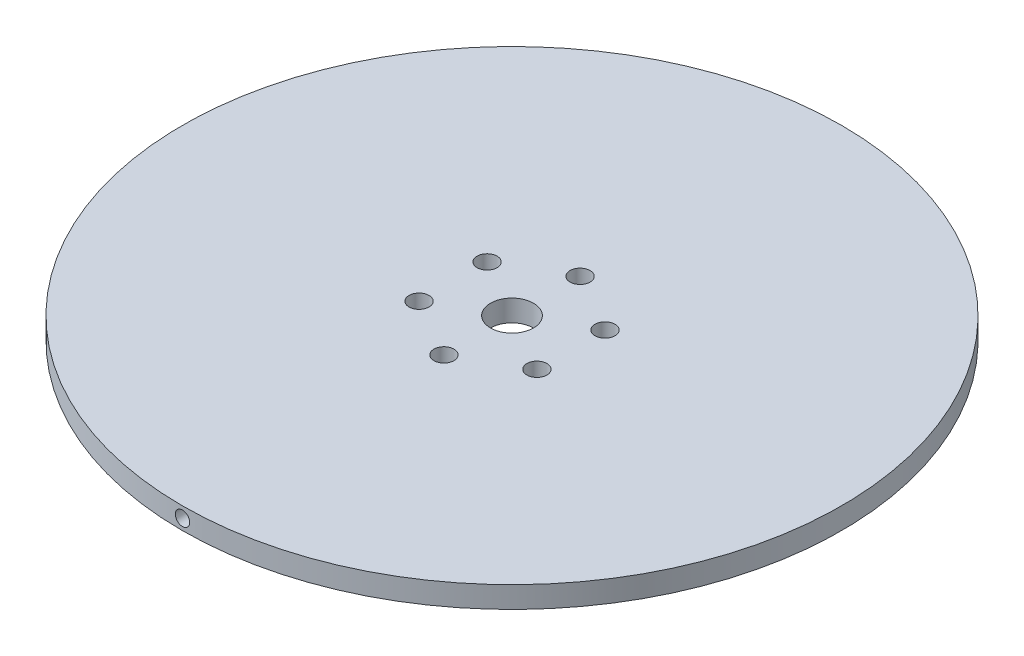
ISO-10303-21;
HEADER;
FILE_DESCRIPTION(('STEP AP214'),'2;1');
FILE_NAME('part.step','',(''),(''),'','','');
FILE_SCHEMA(('AUTOMOTIVE_DESIGN { 1 0 10303 214 1 1 1 1 }'));
ENDSEC;
DATA;
#1=APPLICATION_CONTEXT('core data for automotive mechanical design processes');
#2=APPLICATION_PROTOCOL_DEFINITION('international standard','automotive_design',2000,#1);
#3=PRODUCT_CONTEXT('',#1,'mechanical');
#4=PRODUCT('Part','Part','',(#3));
#5=PRODUCT_RELATED_PRODUCT_CATEGORY('part','',(#4));
#6=PRODUCT_DEFINITION_FORMATION('','',#4);
#7=PRODUCT_DEFINITION_CONTEXT('part definition',#1,'design');
#8=PRODUCT_DEFINITION('design','',#6,#7);
#9=PRODUCT_DEFINITION_SHAPE('','',#8);
#10=(LENGTH_UNIT() NAMED_UNIT(*) SI_UNIT(.MILLI.,.METRE.));
#11=(NAMED_UNIT(*) PLANE_ANGLE_UNIT() SI_UNIT($,.RADIAN.));
#12=(NAMED_UNIT(*) SI_UNIT($,.STERADIAN.) SOLID_ANGLE_UNIT());
#13=UNCERTAINTY_MEASURE_WITH_UNIT(LENGTH_MEASURE(1.E-05),#10,'distance_accuracy_value','');
#14=(GEOMETRIC_REPRESENTATION_CONTEXT(3) GLOBAL_UNCERTAINTY_ASSIGNED_CONTEXT((#13)) GLOBAL_UNIT_ASSIGNED_CONTEXT((#10,
#11,#12)) REPRESENTATION_CONTEXT('',''));
#15=CARTESIAN_POINT('',(0.,0.,0.));
#16=DIRECTION('',(0.,0.,1.));
#17=DIRECTION('',(1.,0.,0.));
#18=AXIS2_PLACEMENT_3D('',#15,#16,#17);
#19=CARTESIAN_POINT('',(0.,3.,0.));
#20=DIRECTION('',(0.,-1.,0.));
#21=DIRECTION('',(0.,0.,-1.));
#22=AXIS2_PLACEMENT_3D('',#19,#20,#21);
#23=CYLINDRICAL_SURFACE('',#22,46.);
#24=CARTESIAN_POINT('',(1.,1.5,45.9891291502677));
#25=CARTESIAN_POINT('',(0.999997511577895,1.44383668192048,45.989129297113));
#26=CARTESIAN_POINT('',(0.995252643432108,1.38763280904419,45.9892331377666));
#27=CARTESIAN_POINT('',(0.976390540344761,1.2767734357133,45.9896373879013));
#28=CARTESIAN_POINT('',(0.962262069324126,1.22211987353279,45.989938033033));
#29=CARTESIAN_POINT('',(0.925035594017819,1.11598320695427,45.9907018186868));
#30=CARTESIAN_POINT('',(0.901941928436637,1.06449858289106,45.9911648805968));
#31=CARTESIAN_POINT('',(0.847446706922223,0.966151427471239,45.992201221132));
#32=CARTESIAN_POINT('',(0.816047196974829,0.919287761727317,45.9927744726045));
#33=CARTESIAN_POINT('',(0.745819770920086,0.83148384653955,45.9939668088042));
#34=CARTESIAN_POINT('',(0.706989982843991,0.790545094380747,45.9945859050574));
#35=CARTESIAN_POINT('',(0.623007049994596,0.715765549477957,45.99580004856));
#36=CARTESIAN_POINT('',(0.57785365518583,0.681925037530667,45.9963950948573));
#37=CARTESIAN_POINT('',(0.482501819334214,0.622301903456958,45.9974940840829));
#38=CARTESIAN_POINT('',(0.432302973228183,0.59651992897683,45.9979980196874));
#39=CARTESIAN_POINT('',(0.328288136177957,0.55375004631892,45.9988579111808));
#40=CARTESIAN_POINT('',(0.274472156301269,0.536762111235011,45.9992138675224));
#41=CARTESIAN_POINT('',(0.164759680973002,0.512065063717347,45.9997376232077));
#42=CARTESIAN_POINT('',(0.108863516241619,0.504354482756667,45.99990545233));
#43=CARTESIAN_POINT('',(-0.0034300616357755,0.498426504052758,46.0000341334473));
#44=CARTESIAN_POINT('',(-0.0598274733021953,0.500209078296704,45.9999949860529));
#45=CARTESIAN_POINT('',(-0.171512663698002,0.513215541532607,45.999714153383));
#46=CARTESIAN_POINT('',(-0.22680062805595,0.524437837390395,45.9994725022838));
#47=CARTESIAN_POINT('',(-0.334707664635909,0.556002724290932,45.9988139406583));
#48=CARTESIAN_POINT('',(-0.387326732436203,0.576345330443284,45.9983970298415));
#49=CARTESIAN_POINT('',(-0.488407388988871,0.625575208410584,45.9974348852464));
#50=CARTESIAN_POINT('',(-0.536868621771618,0.65446321089278,45.9968896404957));
#51=CARTESIAN_POINT('',(-0.628254040646019,0.719963295991373,45.9957322874783));
#52=CARTESIAN_POINT('',(-0.671178221155693,0.75657538639443,45.9951201791442));
#53=CARTESIAN_POINT('',(-0.750280369638865,0.836493387571615,45.993897945175));
#54=CARTESIAN_POINT('',(-0.78645693922167,0.87980068248213,45.9932878199765));
#55=CARTESIAN_POINT('',(-0.851026170394438,0.971874857392614,45.992138466305));
#56=CARTESIAN_POINT('',(-0.879418830844243,1.02064173819228,45.9915992378424));
#57=CARTESIAN_POINT('',(-0.927614105922277,1.12225152082327,45.9906524847887));
#58=CARTESIAN_POINT('',(-0.94741667733152,1.17509444316064,45.9902449608603));
#59=CARTESIAN_POINT('',(-0.9778687539727,1.28335592106462,45.9896075939928));
#60=CARTESIAN_POINT('',(-0.988518272492743,1.33877447289188,45.9893777507958));
#61=CARTESIAN_POINT('',(-1.00036022763924,1.45060190107335,45.9891217059326));
#62=CARTESIAN_POINT('',(-1.00155460004287,1.50701057234752,45.9890954625829));
#63=CARTESIAN_POINT('',(-0.994457401227389,1.6192276579359,45.9892494675996));
#64=CARTESIAN_POINT('',(-0.986165835573732,1.67503607260226,45.9894297158448));
#65=CARTESIAN_POINT('',(-0.96033373303996,1.78446303448477,45.9899763456738));
#66=CARTESIAN_POINT('',(-0.942794073990027,1.83808178902337,45.9903427095914));
#67=CARTESIAN_POINT('',(-0.898964569986483,1.94161372676329,45.9912202533275));
#68=CARTESIAN_POINT('',(-0.872674716316518,1.99152690627331,45.9917314332901));
#69=CARTESIAN_POINT('',(-0.812086112539145,2.08623974269923,45.9928410826945));
#70=CARTESIAN_POINT('',(-0.777786058246107,2.1310385651477,45.9934395663446));
#71=CARTESIAN_POINT('',(-0.702152628091753,2.21424262652956,45.9946563020191));
#72=CARTESIAN_POINT('',(-0.660819241459442,2.25264785567147,45.9952745540738));
#73=CARTESIAN_POINT('',(-0.572284178653449,2.32198097532061,45.9964612484108));
#74=CARTESIAN_POINT('',(-0.525081524371783,2.35290761699258,45.997029682364));
#75=CARTESIAN_POINT('',(-0.426152880853017,2.40639710542382,45.998052540043));
#76=CARTESIAN_POINT('',(-0.37442689924032,2.42895996628051,45.9985069639609));
#77=CARTESIAN_POINT('',(-0.267924639490222,2.46507923624853,45.9992505331713));
#78=CARTESIAN_POINT('',(-0.213148637041824,2.47863645794489,45.9995396933753));
#79=CARTESIAN_POINT('',(-0.102097279266781,2.49636227933337,45.9999201964109));
#80=CARTESIAN_POINT('',(-0.0458219233459414,2.50053087530471,46.0000115391642));
#81=CARTESIAN_POINT('',(0.0666180868227192,2.49936100170221,45.9999861103992));
#82=CARTESIAN_POINT('',(0.122782761647158,2.49402450782439,45.9998693821298));
#83=CARTESIAN_POINT('',(0.233418864334116,2.4739999843119,45.9994410522522));
#84=CARTESIAN_POINT('',(0.287890288816029,2.45931193600794,45.999129450255));
#85=CARTESIAN_POINT('',(0.393594810775896,2.42100135146198,45.9983464828331));
#86=CARTESIAN_POINT('',(0.444827850223864,2.39737865516921,45.9978751145465));
#87=CARTESIAN_POINT('',(0.542599299394092,2.34187050012892,45.9968257525451));
#88=CARTESIAN_POINT('',(0.589137885708025,2.30998535235196,45.9962477628434));
#89=CARTESIAN_POINT('',(0.676207306570353,2.23885342055012,45.9950502035684));
#90=CARTESIAN_POINT('',(0.716737531125554,2.19960588998143,45.9944306297825));
#91=CARTESIAN_POINT('',(0.790644391956378,2.11485207355508,45.9932196268707));
#92=CARTESIAN_POINT('',(0.824019251247659,2.06934423759064,45.9926282047643));
#93=CARTESIAN_POINT('',(0.88267106055026,1.97334851784832,45.9915400427292));
#94=CARTESIAN_POINT('',(0.907943409036848,1.92285782544945,45.991043356667));
#95=CARTESIAN_POINT('',(0.949623312832998,1.81838834589232,45.9902017201949));
#96=CARTESIAN_POINT('',(0.966041465900257,1.76441381567776,45.9898565884792));
#97=CARTESIAN_POINT('',(0.985184160814804,1.67508074004354,45.9894494688706));
#98=CARTESIAN_POINT('',(0.99073313671866,1.64030233894591,45.9893298691666));
#99=CARTESIAN_POINT('',(0.998141835503598,1.57035459748846,45.9891696638733));
#100=CARTESIAN_POINT('',(1.00000155894941,1.53518525718848,45.9891290582719));
#101=CARTESIAN_POINT('',(1.,1.5,45.9891291502677));
#102=B_SPLINE_CURVE_WITH_KNOTS('',3,(#24,#25,#26,#27,#28,#29,#30,#31,#32,#33,#34,#35,#36,#37,
#38,#39,#40,#41,#42,#43,#44,#45,#46,#47,#48,#49,#50,#51,#52,#53,#54,#55,#56,#57,#58,#59,#60,#61,
#62,#63,#64,#65,#66,#67,#68,#69,#70,#71,#72,#73,#74,#75,#76,#77,#78,#79,#80,#81,#82,#83,#84,#85,
#86,#87,#88,#89,#90,#91,#92,#93,#94,#95,#96,#97,#98,#99,#100,#101),.UNSPECIFIED.,.T.,.F.,(4,2,2,
2,2,2,2,2,2,2,2,2,2,2,2,2,2,2,2,2,2,2,2,2,2,2,2,2,2,2,2,2,2,2,2,2,2,2,4),(0.,0.168361525686354,
0.336925014548214,0.505407028626971,0.67384757897122,0.842330621881101,1.01082032849382,
1.17932357276058,1.34782630147397,1.51630235411584,1.68477790961133,1.85322503732739,
2.02167244411056,2.19013425801914,2.35859624175507,2.52709309924956,2.69558998142482,
2.86408771134213,3.03258519663947,3.20104818410662,3.36951107273549,3.53795797372377,
3.70640504250798,3.87487955624733,4.04335432799447,4.21185721362927,4.38035981524547,
4.5488472106898,4.71733467290691,4.88578711797322,5.05423989933639,5.22269569842061,
5.39114515832263,5.55961170820054,5.72812004721579,5.89672391555732,6.06512552823566,
6.17060085788629,6.27607617139129),.UNSPECIFIED.);
#103=CARTESIAN_POINT('',(1.,1.5,45.9891291502677));
#104=VERTEX_POINT('',#103);
#105=EDGE_CURVE('E44',#104,#104,#102,.T.);
#106=ORIENTED_EDGE('',*,*,#105,.T.);
#107=EDGE_LOOP('',(#106));
#108=FACE_BOUND('',#107,.T.);
#109=CARTESIAN_POINT('',(0.,3.,0.));
#110=DIRECTION('',(0.,1.,0.));
#111=DIRECTION('',(0.,0.,1.));
#112=AXIS2_PLACEMENT_3D('',#109,#110,#111);
#113=CIRCLE('',#112,46.);
#114=CARTESIAN_POINT('',(0.,3.,46.));
#115=VERTEX_POINT('',#114);
#116=EDGE_CURVE('E48',#115,#115,#113,.T.);
#117=ORIENTED_EDGE('',*,*,#116,.F.);
#118=EDGE_LOOP('',(#117));
#119=FACE_BOUND('',#118,.T.);
#120=CARTESIAN_POINT('',(0.,0.,0.));
#121=DIRECTION('',(0.,1.,0.));
#122=DIRECTION('',(0.,0.,1.));
#123=AXIS2_PLACEMENT_3D('',#120,#121,#122);
#124=CIRCLE('',#123,46.);
#125=CARTESIAN_POINT('',(0.,0.,46.));
#126=VERTEX_POINT('',#125);
#127=EDGE_CURVE('E52',#126,#126,#124,.T.);
#128=ORIENTED_EDGE('',*,*,#127,.T.);
#129=EDGE_LOOP('',(#128));
#130=FACE_BOUND('',#129,.T.);
#131=CARTESIAN_POINT('',(0.,2.5,-46.));
#132=CARTESIAN_POINT('',(0.056163319848058,2.4999975115795,-45.999999853292));
#133=CARTESIAN_POINT('',(0.112367194486799,2.49525264314499,-45.9998960378786));
#134=CARTESIAN_POINT('',(0.223226571479499,2.47639053880658,-45.9994918777274));
#135=CARTESIAN_POINT('',(0.277880135560748,2.46226206682957,-45.9991912973865));
#136=CARTESIAN_POINT('',(0.384016806156987,2.42503558872489,-45.9984276524474));
#137=CARTESIAN_POINT('',(0.435501432321068,2.40194192125605,-45.997964666455));
#138=CARTESIAN_POINT('',(0.533848591254183,2.34744669529775,-45.9969284555555));
#139=CARTESIAN_POINT('',(0.58071225841321,2.31604718279882,-45.9963552578065));
#140=CARTESIAN_POINT('',(0.668516171975695,2.24581975417801,-45.9951629834455));
#141=CARTESIAN_POINT('',(0.709454921548896,2.20698996665626,-45.9945438952997));
#142=CARTESIAN_POINT('',(0.784234461469103,2.12300703599771,-45.9933297187334));
#143=CARTESIAN_POINT('',(0.818074971011495,2.07785364281843,-45.9927346312632));
#144=CARTESIAN_POINT('',(0.877698102591709,1.98250180836725,-45.9916355284732));
#145=CARTESIAN_POINT('',(0.903480076535621,1.93230296175223,-45.9911315204796));
#146=CARTESIAN_POINT('',(0.946249958061318,1.82828812359524,-45.990271484708));
#147=CARTESIAN_POINT('',(0.963237892555773,1.77447214312346,-45.989915456477));
#148=CARTESIAN_POINT('',(0.987934938810171,1.6647596660834,-45.9893915890842));
#149=CARTESIAN_POINT('',(0.995645519056297,1.60886350022619,-45.9892237201394));
#150=CARTESIAN_POINT('',(1.00157349594113,1.49656992015263,-45.9890950088477));
#151=CARTESIAN_POINT('',(0.999790920600147,1.44017250741628,-45.9891341658897));
#152=CARTESIAN_POINT('',(0.986784455650442,1.32848732192039,-45.9894150631277));
#153=CARTESIAN_POINT('',(0.975562160279575,1.27319936340363,-45.9896567691161));
#154=CARTESIAN_POINT('',(0.943997276386596,1.1652923382553,-45.9903154616555));
#155=CARTESIAN_POINT('',(0.923654672744069,1.11267327604863,-45.9907324484973));
#156=CARTESIAN_POINT('',(0.874424799925698,1.0115926261869,-45.9916947330544));
#157=CARTESIAN_POINT('',(0.845536799489114,0.963131394790606,-45.99224004175));
#158=CARTESIAN_POINT('',(0.780036718730857,0.87174597781691,-45.9933974824854));
#159=CARTESIAN_POINT('',(0.743424630623865,0.828821797820523,-45.9940096145926));
#160=CARTESIAN_POINT('',(0.66350663104734,0.749719646657924,-45.9952318456097));
#161=CARTESIAN_POINT('',(0.620199334979927,0.7135430743484,-45.9958419440724));
#162=CARTESIAN_POINT('',(0.528125156793367,0.648973838229441,-45.996991205381));
#163=CARTESIAN_POINT('',(0.479358273878326,0.62058117555474,-45.9975303682167));
#164=CARTESIAN_POINT('',(0.377748490734636,0.572385898886149,-45.9984769798962));
#165=CARTESIAN_POINT('',(0.324905570330828,0.55258332741384,-45.998884428088));
#166=CARTESIAN_POINT('',(0.216644096620438,0.52213125005136,-45.9995216665753));
#167=CARTESIAN_POINT('',(0.161225547049996,0.511481730884453,-45.9997514571285));
#168=CARTESIAN_POINT('',(0.0493981198216807,0.499639773308245,-46.0000074429437));
#169=CARTESIAN_POINT('',(-0.0070105528215482,0.498445399738928,-46.0000336798664));
#170=CARTESIAN_POINT('',(-0.119227641430148,0.505542596711976,-45.9998797109533));
#171=CARTESIAN_POINT('',(-0.175036057747684,0.513834161688724,-45.9996995052386));
#172=CARTESIAN_POINT('',(-0.284463027355852,0.539666264508076,-45.9991529908142));
#173=CARTESIAN_POINT('',(-0.338081787807381,0.557205925204268,-45.9987866997542));
#174=CARTESIAN_POINT('',(-0.441613736642025,0.601035434486535,-45.9979093001016));
#175=CARTESIAN_POINT('',(-0.491526921337899,0.627325291779369,-45.997398191365));
#176=CARTESIAN_POINT('',(-0.58623976114799,0.687913900803991,-45.9962886516968));
#177=CARTESIAN_POINT('',(-0.631038582384713,0.722213955799282,-45.9956902065613));
#178=CARTESIAN_POINT('',(-0.71424264099322,0.797847386679132,-45.9944734982186));
#179=CARTESIAN_POINT('',(-0.75264786856841,0.83918077334033,-45.9938552349808));
#180=CARTESIAN_POINT('',(-0.82198098504426,0.927715835432465,-45.9926684735204));
#181=CARTESIAN_POINT('',(-0.852907625108546,0.974918488972128,-45.9920999836193));
#182=CARTESIAN_POINT('',(-0.906397110714215,1.07384713059809,-45.9910769937508));
#183=CARTESIAN_POINT('',(-0.928959970353068,1.12557311105997,-45.9906224935912));
#184=CARTESIAN_POINT('',(-0.965079239467388,1.232075371709,-45.9898787850561));
#185=CARTESIAN_POINT('',(-0.978636461001739,1.28685137638563,-45.9895895617776));
#186=CARTESIAN_POINT('',(-0.996362281310417,1.39790273884282,-45.989208973389));
#187=CARTESIAN_POINT('',(-1.00053087637573,1.4541780972157,-45.9891176083572));
#188=CARTESIAN_POINT('',(-0.99936100022156,1.5666181056573,-45.9891430431792));
#189=CARTESIAN_POINT('',(-0.994024505772506,1.6227827763139,-45.98925979975));
#190=CARTESIAN_POINT('',(-0.973999982588101,1.73341887052813,-45.989688224335));
#191=CARTESIAN_POINT('',(-0.959311935175946,1.7878902907038,-45.9899998927384));
#192=CARTESIAN_POINT('',(-0.921001353936654,1.89359480435575,-45.990783002031));
#193=CARTESIAN_POINT('',(-0.897378660050984,1.94482783979923,-45.9912544457826));
#194=CARTESIAN_POINT('',(-0.841870511056812,2.04259928197165,-45.9923039346499));
#195=CARTESIAN_POINT('',(-0.809985366914563,2.08913786528981,-45.9928819757536));
#196=CARTESIAN_POINT('',(-0.73885343900937,2.17620728656839,-45.9940795913759));
#197=CARTESIAN_POINT('',(-0.699605907878802,2.21673751386259,-45.9946991701071));
#198=CARTESIAN_POINT('',(-0.61485208921596,2.29064437995608,-45.9959101341694));
#199=CARTESIAN_POINT('',(-0.56934425158277,2.32401924177803,-45.9965015124689));
#200=CARTESIAN_POINT('',(-0.473348530585262,2.3826710536898,-45.9975895573443));
#201=CARTESIAN_POINT('',(-0.422857838896036,2.40794340274032,-45.9980861700426));
#202=CARTESIAN_POINT('',(-0.318388360862884,2.44962330778989,-45.9989276624674));
#203=CARTESIAN_POINT('',(-0.264413831458836,2.46604146153746,-45.9992727234965));
#204=CARTESIAN_POINT('',(-0.175080753993972,2.48518415844123,-45.999679755331));
#205=CARTESIAN_POINT('',(-0.140302350114764,2.49073313523779,-45.9997993277876));
#206=CARTESIAN_POINT('',(-0.0703546030797177,2.49814183520927,-45.9999594960709));
#207=CARTESIAN_POINT('',(-0.0351852599836758,2.50000155894848,-46.0000000919098));
#208=CARTESIAN_POINT('',(0.,2.5,-46.));
#209=B_SPLINE_CURVE_WITH_KNOTS('',3,(#131,#132,#133,#134,#135,#136,#137,#138,#139,#140,#141,
#142,#143,#144,#145,#146,#147,#148,#149,#150,#151,#152,#153,#154,#155,#156,#157,#158,#159,#160,
#161,#162,#163,#164,#165,#166,#167,#168,#169,#170,#171,#172,#173,#174,#175,#176,#177,#178,#179,
#180,#181,#182,#183,#184,#185,#186,#187,#188,#189,#190,#191,#192,#193,#194,#195,#196,#197,#198,
#199,#200,#201,#202,#203,#204,#205,#206,#207,#208),.UNSPECIFIED.,.T.,.F.,(4,2,2,2,2,2,2,2,2,2,2,
2,2,2,2,2,2,2,2,2,2,2,2,2,2,2,2,2,2,2,2,2,2,2,2,2,2,2,4),(0.,0.168361530997299,
0.336925025054799,0.505407045191684,0.673847601500752,0.8423306374641,1.010820337318,
1.17932358418266,1.34782631536858,1.51630237122311,1.68477792979829,1.8532250408985,
2.02167243126554,2.19013424046154,2.35859621945564,2.52709308383236,2.69558997277245,
2.86408769577498,3.03258517436683,3.2010481661269,3.36951105904593,3.537957976779,
3.70640506212326,3.87487957301684,4.04335434205339,4.21185722500216,4.38035982393161,
4.5488472265349,4.71733469569978,4.88578712867084,5.05423989807406,5.22269568534493,
5.3911451335206,5.55961169053026,5.72812003651302,5.89672390174285,6.06512551148593,
6.17060084950898,6.27607617139906),.UNSPECIFIED.);
#210=CARTESIAN_POINT('',(0.,2.5,-46.));
#211=VERTEX_POINT('',#210);
#212=EDGE_CURVE('E10',#211,#211,#209,.T.);
#213=ORIENTED_EDGE('',*,*,#212,.F.);
#214=EDGE_LOOP('',(#213));
#215=FACE_BOUND('',#214,.T.);
#216=ADVANCED_FACE('F34',(#108,#119,#130,#215),#23,.T.);
#217=CARTESIAN_POINT('',(0.,3.,0.));
#218=DIRECTION('',(0.,1.,0.));
#219=DIRECTION('',(0.,0.,1.));
#220=AXIS2_PLACEMENT_3D('',#217,#218,#219);
#221=PLANE('',#220);
#222=CARTESIAN_POINT('',(-8.22724133595221,3.,4.74999999999992));
#223=DIRECTION('',(0.,1.,0.));
#224=DIRECTION('',(0.,0.,1.));
#225=AXIS2_PLACEMENT_3D('',#222,#223,#224);
#226=CIRCLE('',#225,1.4);
#227=CARTESIAN_POINT('',(-8.22724133595221,3.,6.14999999999992));
#228=VERTEX_POINT('',#227);
#229=EDGE_CURVE('E143',#228,#228,#226,.T.);
#230=ORIENTED_EDGE('',*,*,#229,.F.);
#231=EDGE_LOOP('',(#230));
#232=FACE_BOUND('',#231,.T.);
#233=CARTESIAN_POINT('',(8.22724133595215,3.,4.75000000000004));
#234=DIRECTION('',(0.,1.,0.));
#235=DIRECTION('',(0.,0.,1.));
#236=AXIS2_PLACEMENT_3D('',#233,#234,#235);
#237=CIRCLE('',#236,1.4);
#238=CARTESIAN_POINT('',(8.22724133595215,3.,6.15000000000004));
#239=VERTEX_POINT('',#238);
#240=EDGE_CURVE('E131',#239,#239,#237,.T.);
#241=ORIENTED_EDGE('',*,*,#240,.F.);
#242=EDGE_LOOP('',(#241));
#243=FACE_BOUND('',#242,.T.);
#244=CARTESIAN_POINT('',(0.,3.,-9.5));
#245=DIRECTION('',(0.,1.,0.));
#246=DIRECTION('',(0.,0.,1.));
#247=AXIS2_PLACEMENT_3D('',#244,#245,#246);
#248=CIRCLE('',#247,1.4);
#249=CARTESIAN_POINT('',(0.,3.,-8.1));
#250=VERTEX_POINT('',#249);
#251=EDGE_CURVE('E119',#250,#250,#248,.T.);
#252=ORIENTED_EDGE('',*,*,#251,.F.);
#253=EDGE_LOOP('',(#252));
#254=FACE_BOUND('',#253,.T.);
#255=ORIENTED_EDGE('',*,*,#116,.T.);
#256=EDGE_LOOP('',(#255));
#257=FACE_BOUND('',#256,.T.);
#258=CARTESIAN_POINT('',(0.,3.,0.));
#259=DIRECTION('',(0.,1.,0.));
#260=DIRECTION('',(0.,0.,1.));
#261=AXIS2_PLACEMENT_3D('',#258,#259,#260);
#262=CIRCLE('',#261,3.);
#263=CARTESIAN_POINT('',(0.,3.,3.));
#264=VERTEX_POINT('',#263);
#265=EDGE_CURVE('E113',#264,#264,#262,.T.);
#266=ORIENTED_EDGE('',*,*,#265,.F.);
#267=EDGE_LOOP('',(#266));
#268=FACE_BOUND('',#267,.T.);
#269=CARTESIAN_POINT('',(8.22724133595218,3.,-4.74999999999998));
#270=DIRECTION('',(0.,1.,0.));
#271=DIRECTION('',(0.,0.,1.));
#272=AXIS2_PLACEMENT_3D('',#269,#270,#271);
#273=CIRCLE('',#272,1.4);
#274=CARTESIAN_POINT('',(8.22724133595218,3.,-3.34999999999998));
#275=VERTEX_POINT('',#274);
#276=EDGE_CURVE('E125',#275,#275,#273,.T.);
#277=ORIENTED_EDGE('',*,*,#276,.F.);
#278=EDGE_LOOP('',(#277));
#279=FACE_BOUND('',#278,.T.);
#280=CARTESIAN_POINT('',(0.,3.,9.5));
#281=DIRECTION('',(0.,1.,0.));
#282=DIRECTION('',(0.,0.,1.));
#283=AXIS2_PLACEMENT_3D('',#280,#281,#282);
#284=CIRCLE('',#283,1.4);
#285=CARTESIAN_POINT('',(0.,3.,10.9));
#286=VERTEX_POINT('',#285);
#287=EDGE_CURVE('E137',#286,#286,#284,.T.);
#288=ORIENTED_EDGE('',*,*,#287,.F.);
#289=EDGE_LOOP('',(#288));
#290=FACE_BOUND('',#289,.T.);
#291=CARTESIAN_POINT('',(-8.22724133595211,3.,-4.7500000000001));
#292=DIRECTION('',(0.,1.,0.));
#293=DIRECTION('',(0.,0.,1.));
#294=AXIS2_PLACEMENT_3D('',#291,#292,#293);
#295=CIRCLE('',#294,1.4);
#296=CARTESIAN_POINT('',(-8.22724133595211,3.,-3.3500000000001));
#297=VERTEX_POINT('',#296);
#298=EDGE_CURVE('E148',#297,#297,#295,.T.);
#299=ORIENTED_EDGE('',*,*,#298,.F.);
#300=EDGE_LOOP('',(#299));
#301=FACE_BOUND('',#300,.T.);
#302=ADVANCED_FACE('F94',(#232,#243,#254,#257,#268,#279,#290,#301),#221,.T.);
#303=CARTESIAN_POINT('',(0.,0.,0.));
#304=DIRECTION('',(0.,1.,0.));
#305=DIRECTION('',(0.,0.,1.));
#306=AXIS2_PLACEMENT_3D('',#303,#304,#305);
#307=PLANE('',#306);
#308=CARTESIAN_POINT('',(-8.22724133595221,0.,4.74999999999992));
#309=DIRECTION('',(0.,1.,0.));
#310=DIRECTION('',(0.,0.,1.));
#311=AXIS2_PLACEMENT_3D('',#308,#309,#310);
#312=CIRCLE('',#311,1.4);
#313=CARTESIAN_POINT('',(-8.22724133595221,0.,6.14999999999992));
#314=VERTEX_POINT('',#313);
#315=EDGE_CURVE('E146',#314,#314,#312,.T.);
#316=ORIENTED_EDGE('',*,*,#315,.T.);
#317=EDGE_LOOP('',(#316));
#318=FACE_BOUND('',#317,.T.);
#319=CARTESIAN_POINT('',(8.22724133595215,0.,4.75000000000004));
#320=DIRECTION('',(0.,1.,0.));
#321=DIRECTION('',(0.,0.,1.));
#322=AXIS2_PLACEMENT_3D('',#319,#320,#321);
#323=CIRCLE('',#322,1.4);
#324=CARTESIAN_POINT('',(8.22724133595215,0.,6.15000000000004));
#325=VERTEX_POINT('',#324);
#326=EDGE_CURVE('E134',#325,#325,#323,.T.);
#327=ORIENTED_EDGE('',*,*,#326,.T.);
#328=EDGE_LOOP('',(#327));
#329=FACE_BOUND('',#328,.T.);
#330=CARTESIAN_POINT('',(0.,0.,-9.5));
#331=DIRECTION('',(0.,1.,0.));
#332=DIRECTION('',(0.,0.,1.));
#333=AXIS2_PLACEMENT_3D('',#330,#331,#332);
#334=CIRCLE('',#333,1.4);
#335=CARTESIAN_POINT('',(0.,0.,-8.1));
#336=VERTEX_POINT('',#335);
#337=EDGE_CURVE('E122',#336,#336,#334,.T.);
#338=ORIENTED_EDGE('',*,*,#337,.T.);
#339=EDGE_LOOP('',(#338));
#340=FACE_BOUND('',#339,.T.);
#341=ORIENTED_EDGE('',*,*,#127,.F.);
#342=EDGE_LOOP('',(#341));
#343=FACE_BOUND('',#342,.T.);
#344=CARTESIAN_POINT('',(0.,0.,0.));
#345=DIRECTION('',(0.,1.,0.));
#346=DIRECTION('',(0.,0.,1.));
#347=AXIS2_PLACEMENT_3D('',#344,#345,#346);
#348=CIRCLE('',#347,3.);
#349=CARTESIAN_POINT('',(0.,0.,3.));
#350=VERTEX_POINT('',#349);
#351=EDGE_CURVE('E115',#350,#350,#348,.T.);
#352=ORIENTED_EDGE('',*,*,#351,.T.);
#353=EDGE_LOOP('',(#352));
#354=FACE_BOUND('',#353,.T.);
#355=CARTESIAN_POINT('',(8.22724133595218,0.,-4.74999999999998));
#356=DIRECTION('',(0.,1.,0.));
#357=DIRECTION('',(0.,0.,1.));
#358=AXIS2_PLACEMENT_3D('',#355,#356,#357);
#359=CIRCLE('',#358,1.4);
#360=CARTESIAN_POINT('',(8.22724133595218,0.,-3.34999999999998));
#361=VERTEX_POINT('',#360);
#362=EDGE_CURVE('E128',#361,#361,#359,.T.);
#363=ORIENTED_EDGE('',*,*,#362,.T.);
#364=EDGE_LOOP('',(#363));
#365=FACE_BOUND('',#364,.T.);
#366=CARTESIAN_POINT('',(0.,0.,9.5));
#367=DIRECTION('',(0.,1.,0.));
#368=DIRECTION('',(0.,0.,1.));
#369=AXIS2_PLACEMENT_3D('',#366,#367,#368);
#370=CIRCLE('',#369,1.4);
#371=CARTESIAN_POINT('',(0.,0.,10.9));
#372=VERTEX_POINT('',#371);
#373=EDGE_CURVE('E140',#372,#372,#370,.T.);
#374=ORIENTED_EDGE('',*,*,#373,.T.);
#375=EDGE_LOOP('',(#374));
#376=FACE_BOUND('',#375,.T.);
#377=CARTESIAN_POINT('',(-8.22724133595211,0.,-4.7500000000001));
#378=DIRECTION('',(0.,1.,0.));
#379=DIRECTION('',(0.,0.,1.));
#380=AXIS2_PLACEMENT_3D('',#377,#378,#379);
#381=CIRCLE('',#380,1.4);
#382=CARTESIAN_POINT('',(-8.22724133595211,0.,-3.3500000000001));
#383=VERTEX_POINT('',#382);
#384=EDGE_CURVE('E151',#383,#383,#381,.T.);
#385=ORIENTED_EDGE('',*,*,#384,.T.);
#386=EDGE_LOOP('',(#385));
#387=FACE_BOUND('',#386,.T.);
#388=ADVANCED_FACE('F92',(#318,#329,#340,#343,#354,#365,#376,#387),#307,.F.);
#389=CARTESIAN_POINT('',(0.,3.,0.));
#390=DIRECTION('',(0.,-1.,0.));
#391=DIRECTION('',(0.,0.,-1.));
#392=AXIS2_PLACEMENT_3D('',#389,#390,#391);
#393=CYLINDRICAL_SURFACE('',#392,3.);
#394=ORIENTED_EDGE('',*,*,#265,.T.);
#395=EDGE_LOOP('',(#394));
#396=FACE_BOUND('',#395,.T.);
#397=ORIENTED_EDGE('',*,*,#351,.F.);
#398=EDGE_LOOP('',(#397));
#399=FACE_BOUND('',#398,.T.);
#400=ADVANCED_FACE('F88',(#396,#399),#393,.F.);
#401=CARTESIAN_POINT('',(0.,3.,-9.5));
#402=DIRECTION('',(0.,-1.,0.));
#403=DIRECTION('',(0.,0.,-1.));
#404=AXIS2_PLACEMENT_3D('',#401,#402,#403);
#405=CYLINDRICAL_SURFACE('',#404,1.4);
#406=ORIENTED_EDGE('',*,*,#251,.T.);
#407=EDGE_LOOP('',(#406));
#408=FACE_BOUND('',#407,.T.);
#409=ORIENTED_EDGE('',*,*,#337,.F.);
#410=EDGE_LOOP('',(#409));
#411=FACE_BOUND('',#410,.T.);
#412=ADVANCED_FACE('F84',(#408,#411),#405,.F.);
#413=CARTESIAN_POINT('',(8.22724133595218,3.,-4.74999999999998));
#414=DIRECTION('',(0.,-1.,0.));
#415=DIRECTION('',(0.,0.,-1.));
#416=AXIS2_PLACEMENT_3D('',#413,#414,#415);
#417=CYLINDRICAL_SURFACE('',#416,1.4);
#418=ORIENTED_EDGE('',*,*,#276,.T.);
#419=EDGE_LOOP('',(#418));
#420=FACE_BOUND('',#419,.T.);
#421=ORIENTED_EDGE('',*,*,#362,.F.);
#422=EDGE_LOOP('',(#421));
#423=FACE_BOUND('',#422,.T.);
#424=ADVANCED_FACE('F80',(#420,#423),#417,.F.);
#425=CARTESIAN_POINT('',(8.22724133595215,3.,4.75000000000004));
#426=DIRECTION('',(0.,-1.,0.));
#427=DIRECTION('',(0.,0.,-1.));
#428=AXIS2_PLACEMENT_3D('',#425,#426,#427);
#429=CYLINDRICAL_SURFACE('',#428,1.4);
#430=ORIENTED_EDGE('',*,*,#240,.T.);
#431=EDGE_LOOP('',(#430));
#432=FACE_BOUND('',#431,.T.);
#433=ORIENTED_EDGE('',*,*,#326,.F.);
#434=EDGE_LOOP('',(#433));
#435=FACE_BOUND('',#434,.T.);
#436=ADVANCED_FACE('F76',(#432,#435),#429,.F.);
#437=CARTESIAN_POINT('',(0.,3.,9.5));
#438=DIRECTION('',(0.,-1.,0.));
#439=DIRECTION('',(0.,0.,-1.));
#440=AXIS2_PLACEMENT_3D('',#437,#438,#439);
#441=CYLINDRICAL_SURFACE('',#440,1.4);
#442=ORIENTED_EDGE('',*,*,#287,.T.);
#443=EDGE_LOOP('',(#442));
#444=FACE_BOUND('',#443,.T.);
#445=ORIENTED_EDGE('',*,*,#373,.F.);
#446=EDGE_LOOP('',(#445));
#447=FACE_BOUND('',#446,.T.);
#448=ADVANCED_FACE('F72',(#444,#447),#441,.F.);
#449=CARTESIAN_POINT('',(-8.22724133595221,3.,4.74999999999992));
#450=DIRECTION('',(0.,-1.,0.));
#451=DIRECTION('',(0.,0.,-1.));
#452=AXIS2_PLACEMENT_3D('',#449,#450,#451);
#453=CYLINDRICAL_SURFACE('',#452,1.4);
#454=ORIENTED_EDGE('',*,*,#229,.T.);
#455=EDGE_LOOP('',(#454));
#456=FACE_BOUND('',#455,.T.);
#457=ORIENTED_EDGE('',*,*,#315,.F.);
#458=EDGE_LOOP('',(#457));
#459=FACE_BOUND('',#458,.T.);
#460=ADVANCED_FACE('F68',(#456,#459),#453,.F.);
#461=CARTESIAN_POINT('',(-8.22724133595211,3.,-4.7500000000001));
#462=DIRECTION('',(0.,-1.,0.));
#463=DIRECTION('',(0.,0.,-1.));
#464=AXIS2_PLACEMENT_3D('',#461,#462,#463);
#465=CYLINDRICAL_SURFACE('',#464,1.4);
#466=ORIENTED_EDGE('',*,*,#298,.T.);
#467=EDGE_LOOP('',(#466));
#468=FACE_BOUND('',#467,.T.);
#469=ORIENTED_EDGE('',*,*,#384,.F.);
#470=EDGE_LOOP('',(#469));
#471=FACE_BOUND('',#470,.T.);
#472=ADVANCED_FACE('F64',(#468,#471),#465,.F.);
#473=CARTESIAN_POINT('',(0.,1.5,43.));
#474=DIRECTION('',(0.,0.,1.));
#475=DIRECTION('',(1.,0.,0.));
#476=AXIS2_PLACEMENT_3D('',#473,#474,#475);
#477=CYLINDRICAL_SURFACE('',#476,1.);
#478=CARTESIAN_POINT('',(0.,1.5,43.));
#479=DIRECTION('',(0.,0.,1.));
#480=DIRECTION('',(1.,0.,0.));
#481=AXIS2_PLACEMENT_3D('',#478,#479,#480);
#482=CIRCLE('',#481,1.);
#483=CARTESIAN_POINT('',(1.,1.5,43.));
#484=VERTEX_POINT('',#483);
#485=EDGE_CURVE('E154',#484,#484,#482,.T.);
#486=ORIENTED_EDGE('',*,*,#485,.F.);
#487=EDGE_LOOP('',(#486));
#488=FACE_BOUND('',#487,.T.);
#489=ORIENTED_EDGE('',*,*,#105,.F.);
#490=EDGE_LOOP('',(#489));
#491=FACE_BOUND('',#490,.T.);
#492=ADVANCED_FACE('F58',(#488,#491),#477,.F.);
#493=CARTESIAN_POINT('',(0.,1.5,43.));
#494=DIRECTION('',(0.,0.,1.));
#495=DIRECTION('',(1.,0.,0.));
#496=AXIS2_PLACEMENT_3D('',#493,#494,#495);
#497=PLANE('',#496);
#498=ORIENTED_EDGE('',*,*,#485,.T.);
#499=EDGE_LOOP('',(#498));
#500=FACE_BOUND('',#499,.T.);
#501=ADVANCED_FACE('F63',(#500),#497,.T.);
#502=CARTESIAN_POINT('',(0.,1.5,-43.));
#503=DIRECTION('',(0.,0.,-1.));
#504=DIRECTION('',(-1.,0.,0.));
#505=AXIS2_PLACEMENT_3D('',#502,#503,#504);
#506=CYLINDRICAL_SURFACE('',#505,1.);
#507=CARTESIAN_POINT('',(0.,1.5,-43.));
#508=DIRECTION('',(0.,0.,1.));
#509=DIRECTION('',(1.,0.,0.));
#510=AXIS2_PLACEMENT_3D('',#507,#508,#509);
#511=CIRCLE('',#510,1.);
#512=CARTESIAN_POINT('',(1.,1.5,-43.));
#513=VERTEX_POINT('',#512);
#514=EDGE_CURVE('E159',#513,#513,#511,.T.);
#515=ORIENTED_EDGE('',*,*,#514,.T.);
#516=EDGE_LOOP('',(#515));
#517=FACE_BOUND('',#516,.T.);
#518=ORIENTED_EDGE('',*,*,#212,.T.);
#519=EDGE_LOOP('',(#518));
#520=FACE_BOUND('',#519,.T.);
#521=ADVANCED_FACE('F163',(#517,#520),#506,.F.);
#522=CARTESIAN_POINT('',(0.,1.5,-43.));
#523=DIRECTION('',(0.,0.,1.));
#524=DIRECTION('',(1.,0.,0.));
#525=AXIS2_PLACEMENT_3D('',#522,#523,#524);
#526=PLANE('',#525);
#527=ORIENTED_EDGE('',*,*,#514,.F.);
#528=EDGE_LOOP('',(#527));
#529=FACE_BOUND('',#528,.T.);
#530=ADVANCED_FACE('F165',(#529),#526,.F.);
#531=CLOSED_SHELL('',(#216,#302,#388,#400,#412,#424,#436,#448,#460,#472,#492,#501,#521,#530));
#532=MANIFOLD_SOLID_BREP('B2',#531);
#533=ADVANCED_BREP_SHAPE_REPRESENTATION('',(#18,#532),#14);
#534=SHAPE_DEFINITION_REPRESENTATION(#9,#533);
ENDSEC;
END-ISO-10303-21;
